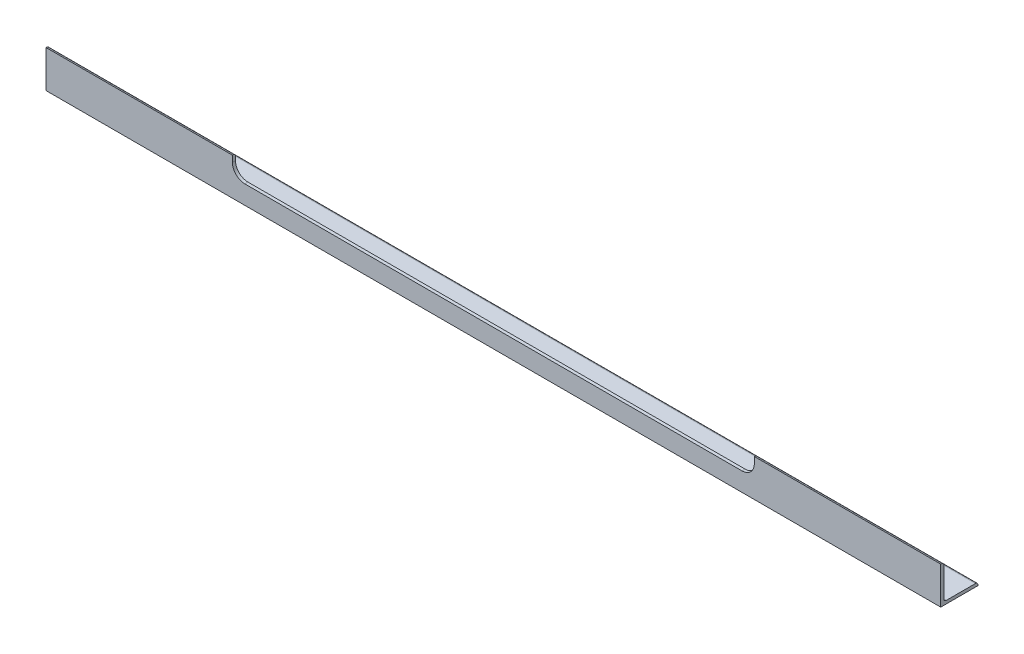
ISO-10303-21;
HEADER;
FILE_DESCRIPTION(('STEP AP214'),'2;1');
FILE_NAME('part.step','',(''),(''),'','','');
FILE_SCHEMA(('AUTOMOTIVE_DESIGN { 1 0 10303 214 1 1 1 1 }'));
ENDSEC;
DATA;
#1=APPLICATION_CONTEXT('core data for automotive mechanical design processes');
#2=APPLICATION_PROTOCOL_DEFINITION('international standard','automotive_design',2000,#1);
#3=PRODUCT_CONTEXT('',#1,'mechanical');
#4=PRODUCT('Part','Part','',(#3));
#5=PRODUCT_RELATED_PRODUCT_CATEGORY('part','',(#4));
#6=PRODUCT_DEFINITION_FORMATION('','',#4);
#7=PRODUCT_DEFINITION_CONTEXT('part definition',#1,'design');
#8=PRODUCT_DEFINITION('design','',#6,#7);
#9=PRODUCT_DEFINITION_SHAPE('','',#8);
#10=(LENGTH_UNIT() NAMED_UNIT(*) SI_UNIT(.MILLI.,.METRE.));
#11=(NAMED_UNIT(*) PLANE_ANGLE_UNIT() SI_UNIT($,.RADIAN.));
#12=(NAMED_UNIT(*) SI_UNIT($,.STERADIAN.) SOLID_ANGLE_UNIT());
#13=UNCERTAINTY_MEASURE_WITH_UNIT(LENGTH_MEASURE(1.E-05),#10,'distance_accuracy_value','');
#14=(GEOMETRIC_REPRESENTATION_CONTEXT(3) GLOBAL_UNCERTAINTY_ASSIGNED_CONTEXT((#13)) GLOBAL_UNIT_ASSIGNED_CONTEXT((#10,
#11,#12)) REPRESENTATION_CONTEXT('',''));
#15=CARTESIAN_POINT('',(0.,0.,0.));
#16=DIRECTION('',(0.,0.,1.));
#17=DIRECTION('',(1.,0.,0.));
#18=AXIS2_PLACEMENT_3D('',#15,#16,#17);
#19=CARTESIAN_POINT('',(-914.4,76.2,0.));
#20=DIRECTION('',(0.,1.,0.));
#21=DIRECTION('',(0.,0.,1.));
#22=AXIS2_PLACEMENT_3D('',#19,#20,#21);
#23=PLANE('',#22);
#24=DIRECTION('',(0.,0.,1.));
#25=VECTOR('',#24,1.);
#26=CARTESIAN_POINT('',(-533.4,76.2,-76.2));
#27=LINE('',#26,#25);
#28=CARTESIAN_POINT('',(-533.4,76.2,-1.27000000000002));
#29=VERTEX_POINT('',#28);
#30=CARTESIAN_POINT('',(-533.4,76.2,0.));
#31=VERTEX_POINT('',#30);
#32=EDGE_CURVE('E167',#29,#31,#27,.T.);
#33=ORIENTED_EDGE('',*,*,#32,.F.);
#34=DIRECTION('',(1.,0.,0.));
#35=VECTOR('',#34,1.);
#36=CARTESIAN_POINT('',(-914.4,76.2,-1.26999999999996));
#37=LINE('',#36,#35);
#38=CARTESIAN_POINT('',(-914.4,76.2,-1.26999999999996));
#39=VERTEX_POINT('',#38);
#40=EDGE_CURVE('E186',#39,#29,#37,.T.);
#41=ORIENTED_EDGE('',*,*,#40,.F.);
#42=DIRECTION('',(0.,0.,1.));
#43=VECTOR('',#42,1.);
#44=CARTESIAN_POINT('',(-914.4,76.2,0.));
#45=LINE('',#44,#43);
#46=CARTESIAN_POINT('',(-914.4,76.2,0.));
#47=VERTEX_POINT('',#46);
#48=EDGE_CURVE('E248',#39,#47,#45,.T.);
#49=ORIENTED_EDGE('',*,*,#48,.T.);
#50=DIRECTION('',(1.,0.,0.));
#51=VECTOR('',#50,1.);
#52=CARTESIAN_POINT('',(-914.4,76.2,0.));
#53=LINE('',#52,#51);
#54=EDGE_CURVE('E173',#47,#31,#53,.T.);
#55=ORIENTED_EDGE('',*,*,#54,.T.);
#56=EDGE_LOOP('',(#33,#41,#49,#55));
#57=FACE_BOUND('',#56,.T.);
#58=ADVANCED_FACE('F37',(#57),#23,.T.);
#59=CARTESIAN_POINT('',(-914.4,71.12,-1.27));
#60=DIRECTION('',(1.,0.,0.));
#61=DIRECTION('',(0.,0.,-1.));
#62=AXIS2_PLACEMENT_3D('',#59,#60,#61);
#63=CYLINDRICAL_SURFACE('',#62,5.08);
#64=CARTESIAN_POINT('',(-533.4,71.12,-1.27));
#65=DIRECTION('',(-1.,0.,0.));
#66=DIRECTION('',(0.,0.,1.));
#67=AXIS2_PLACEMENT_3D('',#64,#65,#66);
#68=CIRCLE('',#67,5.08);
#69=CARTESIAN_POINT('',(-533.4,71.12,-6.35));
#70=VERTEX_POINT('',#69);
#71=EDGE_CURVE('E222',#70,#29,#68,.F.);
#72=ORIENTED_EDGE('',*,*,#71,.F.);
#73=DIRECTION('',(1.,0.,0.));
#74=VECTOR('',#73,1.);
#75=CARTESIAN_POINT('',(-914.4,71.12,-6.35));
#76=LINE('',#75,#74);
#77=CARTESIAN_POINT('',(-914.4,71.12,-6.35));
#78=VERTEX_POINT('',#77);
#79=EDGE_CURVE('E273',#78,#70,#76,.T.);
#80=ORIENTED_EDGE('',*,*,#79,.F.);
#81=CARTESIAN_POINT('',(-914.4,71.12,-1.27));
#82=DIRECTION('',(1.,0.,0.));
#83=DIRECTION('',(0.,0.,-1.));
#84=AXIS2_PLACEMENT_3D('',#81,#82,#83);
#85=CIRCLE('',#84,5.08);
#86=EDGE_CURVE('E174',#78,#39,#85,.T.);
#87=ORIENTED_EDGE('',*,*,#86,.T.);
#88=ORIENTED_EDGE('',*,*,#40,.T.);
#89=EDGE_LOOP('',(#72,#80,#87,#88));
#90=FACE_BOUND('',#89,.T.);
#91=ADVANCED_FACE('F307',(#90),#63,.T.);
#92=DIRECTION('',(0.,0.,1.));
#93=VECTOR('',#92,1.);
#94=CARTESIAN_POINT('',(533.4,76.2,-76.2));
#95=LINE('',#94,#93);
#96=CARTESIAN_POINT('',(533.4,76.2,-1.27));
#97=VERTEX_POINT('',#96);
#98=CARTESIAN_POINT('',(533.4,76.2,0.));
#99=VERTEX_POINT('',#98);
#100=EDGE_CURVE('E153',#97,#99,#95,.T.);
#101=ORIENTED_EDGE('',*,*,#100,.T.);
#102=CARTESIAN_POINT('',(914.4,76.2,0.));
#103=VERTEX_POINT('',#102);
#104=EDGE_CURVE('E164',#99,#103,#53,.T.);
#105=ORIENTED_EDGE('',*,*,#104,.T.);
#106=DIRECTION('',(0.,0.,1.));
#107=VECTOR('',#106,1.);
#108=CARTESIAN_POINT('',(914.4,76.2,0.));
#109=LINE('',#108,#107);
#110=CARTESIAN_POINT('',(914.4,76.2,-1.26999999999996));
#111=VERTEX_POINT('',#110);
#112=EDGE_CURVE('E224',#111,#103,#109,.T.);
#113=ORIENTED_EDGE('',*,*,#112,.F.);
#114=EDGE_CURVE('E166',#97,#111,#37,.T.);
#115=ORIENTED_EDGE('',*,*,#114,.F.);
#116=EDGE_LOOP('',(#101,#105,#113,#115));
#117=FACE_BOUND('',#116,.T.);
#118=ADVANCED_FACE('F162',(#117),#23,.T.);
#119=CARTESIAN_POINT('',(533.4,71.12,-1.27));
#120=DIRECTION('',(1.,0.,0.));
#121=DIRECTION('',(0.,0.,-1.));
#122=AXIS2_PLACEMENT_3D('',#119,#120,#121);
#123=CIRCLE('',#122,5.08);
#124=CARTESIAN_POINT('',(533.4,71.12,-6.35));
#125=VERTEX_POINT('',#124);
#126=EDGE_CURVE('E206',#97,#125,#123,.F.);
#127=ORIENTED_EDGE('',*,*,#126,.F.);
#128=ORIENTED_EDGE('',*,*,#114,.T.);
#129=CARTESIAN_POINT('',(914.4,71.12,-1.27));
#130=DIRECTION('',(1.,0.,0.));
#131=DIRECTION('',(0.,0.,-1.));
#132=AXIS2_PLACEMENT_3D('',#129,#130,#131);
#133=CIRCLE('',#132,5.08);
#134=CARTESIAN_POINT('',(914.4,71.12,-6.35));
#135=VERTEX_POINT('',#134);
#136=EDGE_CURVE('E245',#135,#111,#133,.T.);
#137=ORIENTED_EDGE('',*,*,#136,.F.);
#138=EDGE_CURVE('E276',#125,#135,#76,.T.);
#139=ORIENTED_EDGE('',*,*,#138,.F.);
#140=EDGE_LOOP('',(#127,#128,#137,#139));
#141=FACE_BOUND('',#140,.T.);
#142=ADVANCED_FACE('F316',(#141),#63,.T.);
#143=CARTESIAN_POINT('',(-914.4,71.12,-6.35));
#144=DIRECTION('',(0.,0.,-1.));
#145=DIRECTION('',(-1.,0.,0.));
#146=AXIS2_PLACEMENT_3D('',#143,#144,#145);
#147=PLANE('',#146);
#148=DIRECTION('',(0.,1.,0.));
#149=VECTOR('',#148,1.);
#150=CARTESIAN_POINT('',(-533.4,71.12,-6.35));
#151=LINE('',#150,#149);
#152=CARTESIAN_POINT('',(-533.4,63.5,-6.35));
#153=VERTEX_POINT('',#152);
#154=EDGE_CURVE('E220',#153,#70,#151,.T.);
#155=ORIENTED_EDGE('',*,*,#154,.F.);
#156=CARTESIAN_POINT('',(-508.,63.5,-6.34999999999999));
#157=DIRECTION('',(0.,0.,-1.));
#158=DIRECTION('',(-1.,0.,0.));
#159=AXIS2_PLACEMENT_3D('',#156,#157,#158);
#160=CIRCLE('',#159,25.4);
#161=CARTESIAN_POINT('',(-508.,38.1,-6.35));
#162=VERTEX_POINT('',#161);
#163=EDGE_CURVE('E11',#153,#162,#160,.F.);
#164=ORIENTED_EDGE('',*,*,#163,.T.);
#165=DIRECTION('',(-1.,0.,0.));
#166=VECTOR('',#165,1.);
#167=CARTESIAN_POINT('',(-914.4,38.1,-6.35));
#168=LINE('',#167,#166);
#169=CARTESIAN_POINT('',(508.,38.1,-6.35));
#170=VERTEX_POINT('',#169);
#171=EDGE_CURVE('E203',#170,#162,#168,.T.);
#172=ORIENTED_EDGE('',*,*,#171,.F.);
#173=CARTESIAN_POINT('',(508.,63.5,-6.34999999999999));
#174=DIRECTION('',(0.,0.,-1.));
#175=DIRECTION('',(-1.,0.,0.));
#176=AXIS2_PLACEMENT_3D('',#173,#174,#175);
#177=CIRCLE('',#176,25.4);
#178=CARTESIAN_POINT('',(533.4,63.5,-6.35));
#179=VERTEX_POINT('',#178);
#180=EDGE_CURVE('E194',#170,#179,#177,.F.);
#181=ORIENTED_EDGE('',*,*,#180,.T.);
#182=DIRECTION('',(0.,-1.,0.));
#183=VECTOR('',#182,1.);
#184=CARTESIAN_POINT('',(533.4,71.12,-6.35));
#185=LINE('',#184,#183);
#186=EDGE_CURVE('E200',#125,#179,#185,.T.);
#187=ORIENTED_EDGE('',*,*,#186,.F.);
#188=ORIENTED_EDGE('',*,*,#138,.T.);
#189=DIRECTION('',(0.,1.,0.));
#190=VECTOR('',#189,1.);
#191=CARTESIAN_POINT('',(914.4,71.12,-6.35));
#192=LINE('',#191,#190);
#193=CARTESIAN_POINT('',(914.4,11.43,-6.35));
#194=VERTEX_POINT('',#193);
#195=EDGE_CURVE('E242',#194,#135,#192,.T.);
#196=ORIENTED_EDGE('',*,*,#195,.F.);
#197=DIRECTION('',(1.,0.,0.));
#198=VECTOR('',#197,1.);
#199=CARTESIAN_POINT('',(-914.4,11.43,-6.35));
#200=LINE('',#199,#198);
#201=CARTESIAN_POINT('',(-914.4,11.43,-6.35));
#202=VERTEX_POINT('',#201);
#203=EDGE_CURVE('E277',#202,#194,#200,.T.);
#204=ORIENTED_EDGE('',*,*,#203,.F.);
#205=DIRECTION('',(0.,1.,0.));
#206=VECTOR('',#205,1.);
#207=CARTESIAN_POINT('',(-914.4,71.12,-6.35));
#208=LINE('',#207,#206);
#209=EDGE_CURVE('E179',#202,#78,#208,.T.);
#210=ORIENTED_EDGE('',*,*,#209,.T.);
#211=ORIENTED_EDGE('',*,*,#79,.T.);
#212=EDGE_LOOP('',(#155,#164,#172,#181,#187,#188,#196,#204,#210,#211));
#213=FACE_BOUND('',#212,.T.);
#214=ADVANCED_FACE('F199',(#213),#147,.T.);
#215=CARTESIAN_POINT('',(-914.4,11.43,-11.43));
#216=DIRECTION('',(1.,0.,0.));
#217=DIRECTION('',(0.,0.,-1.));
#218=AXIS2_PLACEMENT_3D('',#215,#216,#217);
#219=CYLINDRICAL_SURFACE('',#218,5.08);
#220=ORIENTED_EDGE('',*,*,#203,.T.);
#221=CARTESIAN_POINT('',(914.4,11.43,-11.43));
#222=DIRECTION('',(-1.,0.,0.));
#223=DIRECTION('',(0.,0.,-1.));
#224=AXIS2_PLACEMENT_3D('',#221,#222,#223);
#225=CIRCLE('',#224,5.08);
#226=CARTESIAN_POINT('',(914.4,6.35,-11.43));
#227=VERTEX_POINT('',#226);
#228=EDGE_CURVE('E239',#227,#194,#225,.T.);
#229=ORIENTED_EDGE('',*,*,#228,.F.);
#230=DIRECTION('',(1.,0.,0.));
#231=VECTOR('',#230,1.);
#232=CARTESIAN_POINT('',(-914.4,6.35,-11.43));
#233=LINE('',#232,#231);
#234=CARTESIAN_POINT('',(-914.4,6.35,-11.43));
#235=VERTEX_POINT('',#234);
#236=EDGE_CURVE('E279',#235,#227,#233,.T.);
#237=ORIENTED_EDGE('',*,*,#236,.F.);
#238=CARTESIAN_POINT('',(-914.4,11.43,-11.43));
#239=DIRECTION('',(-1.,0.,0.));
#240=DIRECTION('',(0.,0.,-1.));
#241=AXIS2_PLACEMENT_3D('',#238,#239,#240);
#242=CIRCLE('',#241,5.08);
#243=EDGE_CURVE('E266',#235,#202,#242,.T.);
#244=ORIENTED_EDGE('',*,*,#243,.T.);
#245=EDGE_LOOP('',(#220,#229,#237,#244));
#246=FACE_BOUND('',#245,.T.);
#247=ADVANCED_FACE('F326',(#246),#219,.F.);
#248=CARTESIAN_POINT('',(-914.4,6.35,-11.43));
#249=DIRECTION('',(0.,1.,0.));
#250=DIRECTION('',(0.,0.,1.));
#251=AXIS2_PLACEMENT_3D('',#248,#249,#250);
#252=PLANE('',#251);
#253=ORIENTED_EDGE('',*,*,#236,.T.);
#254=DIRECTION('',(0.,0.,1.));
#255=VECTOR('',#254,1.);
#256=CARTESIAN_POINT('',(914.4,6.35,-11.43));
#257=LINE('',#256,#255);
#258=CARTESIAN_POINT('',(914.4,6.35,-71.12));
#259=VERTEX_POINT('',#258);
#260=EDGE_CURVE('E236',#259,#227,#257,.T.);
#261=ORIENTED_EDGE('',*,*,#260,.F.);
#262=DIRECTION('',(1.,0.,0.));
#263=VECTOR('',#262,1.);
#264=CARTESIAN_POINT('',(-914.4,6.35,-71.12));
#265=LINE('',#264,#263);
#266=CARTESIAN_POINT('',(-914.4,6.35,-71.12));
#267=VERTEX_POINT('',#266);
#268=EDGE_CURVE('E281',#267,#259,#265,.T.);
#269=ORIENTED_EDGE('',*,*,#268,.F.);
#270=DIRECTION('',(0.,0.,1.));
#271=VECTOR('',#270,1.);
#272=CARTESIAN_POINT('',(-914.4,6.35,-11.43));
#273=LINE('',#272,#271);
#274=EDGE_CURVE('E263',#267,#235,#273,.T.);
#275=ORIENTED_EDGE('',*,*,#274,.T.);
#276=EDGE_LOOP('',(#253,#261,#269,#275));
#277=FACE_BOUND('',#276,.T.);
#278=ADVANCED_FACE('F333',(#277),#252,.T.);
#279=CARTESIAN_POINT('',(-914.4,1.27,-71.12));
#280=DIRECTION('',(1.,0.,0.));
#281=DIRECTION('',(0.,0.,-1.));
#282=AXIS2_PLACEMENT_3D('',#279,#280,#281);
#283=CYLINDRICAL_SURFACE('',#282,5.08);
#284=ORIENTED_EDGE('',*,*,#268,.T.);
#285=CARTESIAN_POINT('',(914.4,1.27,-71.12));
#286=DIRECTION('',(1.,0.,0.));
#287=DIRECTION('',(0.,0.,1.));
#288=AXIS2_PLACEMENT_3D('',#285,#286,#287);
#289=CIRCLE('',#288,5.08);
#290=CARTESIAN_POINT('',(914.4,1.26999999999996,-76.2));
#291=VERTEX_POINT('',#290);
#292=EDGE_CURVE('E233',#291,#259,#289,.T.);
#293=ORIENTED_EDGE('',*,*,#292,.F.);
#294=DIRECTION('',(1.,0.,0.));
#295=VECTOR('',#294,1.);
#296=CARTESIAN_POINT('',(-914.4,1.26999999999996,-76.2));
#297=LINE('',#296,#295);
#298=CARTESIAN_POINT('',(-914.4,1.26999999999996,-76.2));
#299=VERTEX_POINT('',#298);
#300=EDGE_CURVE('E283',#299,#291,#297,.T.);
#301=ORIENTED_EDGE('',*,*,#300,.F.);
#302=CARTESIAN_POINT('',(-914.4,1.27,-71.12));
#303=DIRECTION('',(1.,0.,0.));
#304=DIRECTION('',(0.,0.,1.));
#305=AXIS2_PLACEMENT_3D('',#302,#303,#304);
#306=CIRCLE('',#305,5.08);
#307=EDGE_CURVE('E260',#299,#267,#306,.T.);
#308=ORIENTED_EDGE('',*,*,#307,.T.);
#309=EDGE_LOOP('',(#284,#293,#301,#308));
#310=FACE_BOUND('',#309,.T.);
#311=ADVANCED_FACE('F303',(#310),#283,.T.);
#312=CARTESIAN_POINT('',(-914.4,1.26999999999996,-76.2));
#313=DIRECTION('',(0.,0.,-1.));
#314=DIRECTION('',(-1.,0.,0.));
#315=AXIS2_PLACEMENT_3D('',#312,#313,#314);
#316=PLANE('',#315);
#317=ORIENTED_EDGE('',*,*,#300,.T.);
#318=DIRECTION('',(0.,1.,0.));
#319=VECTOR('',#318,1.);
#320=CARTESIAN_POINT('',(914.4,1.26999999999996,-76.2));
#321=LINE('',#320,#319);
#322=CARTESIAN_POINT('',(914.4,0.,-76.2));
#323=VERTEX_POINT('',#322);
#324=EDGE_CURVE('E230',#323,#291,#321,.T.);
#325=ORIENTED_EDGE('',*,*,#324,.F.);
#326=DIRECTION('',(1.,0.,0.));
#327=VECTOR('',#326,1.);
#328=CARTESIAN_POINT('',(-914.4,0.,-76.2));
#329=LINE('',#328,#327);
#330=CARTESIAN_POINT('',(-914.4,0.,-76.2));
#331=VERTEX_POINT('',#330);
#332=EDGE_CURVE('E284',#331,#323,#329,.T.);
#333=ORIENTED_EDGE('',*,*,#332,.F.);
#334=DIRECTION('',(0.,1.,0.));
#335=VECTOR('',#334,1.);
#336=CARTESIAN_POINT('',(-914.4,1.26999999999996,-76.2));
#337=LINE('',#336,#335);
#338=EDGE_CURVE('E257',#331,#299,#337,.T.);
#339=ORIENTED_EDGE('',*,*,#338,.T.);
#340=EDGE_LOOP('',(#317,#325,#333,#339));
#341=FACE_BOUND('',#340,.T.);
#342=ADVANCED_FACE('F294',(#341),#316,.T.);
#343=CARTESIAN_POINT('',(-914.4,0.,0.));
#344=DIRECTION('',(0.,-1.,0.));
#345=DIRECTION('',(0.,0.,-1.));
#346=AXIS2_PLACEMENT_3D('',#343,#344,#345);
#347=PLANE('',#346);
#348=ORIENTED_EDGE('',*,*,#332,.T.);
#349=DIRECTION('',(0.,0.,-1.));
#350=VECTOR('',#349,1.);
#351=CARTESIAN_POINT('',(914.4,0.,0.));
#352=LINE('',#351,#350);
#353=CARTESIAN_POINT('',(914.4,0.,0.));
#354=VERTEX_POINT('',#353);
#355=EDGE_CURVE('E227',#354,#323,#352,.T.);
#356=ORIENTED_EDGE('',*,*,#355,.F.);
#357=DIRECTION('',(1.,0.,0.));
#358=VECTOR('',#357,1.);
#359=CARTESIAN_POINT('',(-914.4,0.,0.));
#360=LINE('',#359,#358);
#361=CARTESIAN_POINT('',(-914.4,0.,0.));
#362=VERTEX_POINT('',#361);
#363=EDGE_CURVE('E177',#362,#354,#360,.T.);
#364=ORIENTED_EDGE('',*,*,#363,.F.);
#365=DIRECTION('',(0.,0.,-1.));
#366=VECTOR('',#365,1.);
#367=CARTESIAN_POINT('',(-914.4,0.,0.));
#368=LINE('',#367,#366);
#369=EDGE_CURVE('E254',#362,#331,#368,.T.);
#370=ORIENTED_EDGE('',*,*,#369,.T.);
#371=EDGE_LOOP('',(#348,#356,#364,#370));
#372=FACE_BOUND('',#371,.T.);
#373=ADVANCED_FACE('F292',(#372),#347,.T.);
#374=CARTESIAN_POINT('',(-914.4,76.2,0.));
#375=DIRECTION('',(0.,0.,1.));
#376=DIRECTION('',(1.,0.,0.));
#377=AXIS2_PLACEMENT_3D('',#374,#375,#376);
#378=PLANE('',#377);
#379=DIRECTION('',(0.,-1.,0.));
#380=VECTOR('',#379,1.);
#381=CARTESIAN_POINT('',(-533.4,76.2,0.));
#382=LINE('',#381,#380);
#383=CARTESIAN_POINT('',(-533.4,63.5,0.));
#384=VERTEX_POINT('',#383);
#385=EDGE_CURVE('E213',#31,#384,#382,.T.);
#386=ORIENTED_EDGE('',*,*,#385,.F.);
#387=ORIENTED_EDGE('',*,*,#54,.F.);
#388=DIRECTION('',(0.,-1.,0.));
#389=VECTOR('',#388,1.);
#390=CARTESIAN_POINT('',(-914.4,76.2,0.));
#391=LINE('',#390,#389);
#392=EDGE_CURVE('E251',#47,#362,#391,.T.);
#393=ORIENTED_EDGE('',*,*,#392,.T.);
#394=ORIENTED_EDGE('',*,*,#363,.T.);
#395=DIRECTION('',(0.,-1.,0.));
#396=VECTOR('',#395,1.);
#397=CARTESIAN_POINT('',(914.4,76.2,0.));
#398=LINE('',#397,#396);
#399=EDGE_CURVE('E171',#103,#354,#398,.T.);
#400=ORIENTED_EDGE('',*,*,#399,.F.);
#401=ORIENTED_EDGE('',*,*,#104,.F.);
#402=DIRECTION('',(0.,1.,0.));
#403=VECTOR('',#402,1.);
#404=CARTESIAN_POINT('',(533.4,76.2,0.));
#405=LINE('',#404,#403);
#406=CARTESIAN_POINT('',(533.4,63.5,0.));
#407=VERTEX_POINT('',#406);
#408=EDGE_CURVE('E149',#407,#99,#405,.T.);
#409=ORIENTED_EDGE('',*,*,#408,.F.);
#410=CARTESIAN_POINT('',(508.,63.5,0.));
#411=DIRECTION('',(0.,0.,1.));
#412=DIRECTION('',(1.,0.,0.));
#413=AXIS2_PLACEMENT_3D('',#410,#411,#412);
#414=CIRCLE('',#413,25.4);
#415=CARTESIAN_POINT('',(508.,38.1,0.));
#416=VERTEX_POINT('',#415);
#417=EDGE_CURVE('E192',#407,#416,#414,.F.);
#418=ORIENTED_EDGE('',*,*,#417,.T.);
#419=DIRECTION('',(1.,0.,0.));
#420=VECTOR('',#419,1.);
#421=CARTESIAN_POINT('',(-533.4,38.1,0.));
#422=LINE('',#421,#420);
#423=CARTESIAN_POINT('',(-508.,38.1,0.));
#424=VERTEX_POINT('',#423);
#425=EDGE_CURVE('E158',#424,#416,#422,.T.);
#426=ORIENTED_EDGE('',*,*,#425,.F.);
#427=CARTESIAN_POINT('',(-508.,63.5,0.));
#428=DIRECTION('',(0.,0.,1.));
#429=DIRECTION('',(1.,0.,0.));
#430=AXIS2_PLACEMENT_3D('',#427,#428,#429);
#431=CIRCLE('',#430,25.4);
#432=EDGE_CURVE('E45',#424,#384,#431,.F.);
#433=ORIENTED_EDGE('',*,*,#432,.T.);
#434=EDGE_LOOP('',(#386,#387,#393,#394,#400,#401,#409,#418,#426,#433));
#435=FACE_BOUND('',#434,.T.);
#436=ADVANCED_FACE('F169',(#435),#378,.T.);
#437=CARTESIAN_POINT('',(-914.4,71.12,-1.27));
#438=DIRECTION('',(1.,0.,0.));
#439=DIRECTION('',(0.,0.,-1.));
#440=AXIS2_PLACEMENT_3D('',#437,#438,#439);
#441=PLANE('',#440);
#442=ORIENTED_EDGE('',*,*,#48,.F.);
#443=ORIENTED_EDGE('',*,*,#86,.F.);
#444=ORIENTED_EDGE('',*,*,#209,.F.);
#445=ORIENTED_EDGE('',*,*,#243,.F.);
#446=ORIENTED_EDGE('',*,*,#274,.F.);
#447=ORIENTED_EDGE('',*,*,#307,.F.);
#448=ORIENTED_EDGE('',*,*,#338,.F.);
#449=ORIENTED_EDGE('',*,*,#369,.F.);
#450=ORIENTED_EDGE('',*,*,#392,.F.);
#451=EDGE_LOOP('',(#442,#443,#444,#445,#446,#447,#448,#449,#450));
#452=FACE_BOUND('',#451,.T.);
#453=ADVANCED_FACE('F301',(#452),#441,.F.);
#454=CARTESIAN_POINT('',(914.4,71.12,-1.27));
#455=DIRECTION('',(1.,0.,0.));
#456=DIRECTION('',(0.,0.,-1.));
#457=AXIS2_PLACEMENT_3D('',#454,#455,#456);
#458=PLANE('',#457);
#459=ORIENTED_EDGE('',*,*,#112,.T.);
#460=ORIENTED_EDGE('',*,*,#399,.T.);
#461=ORIENTED_EDGE('',*,*,#355,.T.);
#462=ORIENTED_EDGE('',*,*,#324,.T.);
#463=ORIENTED_EDGE('',*,*,#292,.T.);
#464=ORIENTED_EDGE('',*,*,#260,.T.);
#465=ORIENTED_EDGE('',*,*,#228,.T.);
#466=ORIENTED_EDGE('',*,*,#195,.T.);
#467=ORIENTED_EDGE('',*,*,#136,.T.);
#468=EDGE_LOOP('',(#459,#460,#461,#462,#463,#464,#465,#466,#467));
#469=FACE_BOUND('',#468,.T.);
#470=ADVANCED_FACE('F290',(#469),#458,.T.);
#471=CARTESIAN_POINT('',(-533.4,76.2,-76.2));
#472=DIRECTION('',(-1.,0.,0.));
#473=DIRECTION('',(0.,0.,1.));
#474=AXIS2_PLACEMENT_3D('',#471,#472,#473);
#475=PLANE('',#474);
#476=ORIENTED_EDGE('',*,*,#385,.T.);
#477=DIRECTION('',(0.,0.,1.));
#478=VECTOR('',#477,1.);
#479=CARTESIAN_POINT('',(-533.4,63.5,-6.35000000000002));
#480=LINE('',#479,#478);
#481=EDGE_CURVE('E52',#384,#153,#480,.F.);
#482=ORIENTED_EDGE('',*,*,#481,.T.);
#483=ORIENTED_EDGE('',*,*,#154,.T.);
#484=ORIENTED_EDGE('',*,*,#71,.T.);
#485=ORIENTED_EDGE('',*,*,#32,.T.);
#486=EDGE_LOOP('',(#476,#482,#483,#484,#485));
#487=FACE_BOUND('',#486,.T.);
#488=ADVANCED_FACE('F356',(#487),#475,.F.);
#489=CARTESIAN_POINT('',(533.4,76.2,-76.2));
#490=DIRECTION('',(1.,0.,0.));
#491=DIRECTION('',(0.,0.,-1.));
#492=AXIS2_PLACEMENT_3D('',#489,#490,#491);
#493=PLANE('',#492);
#494=ORIENTED_EDGE('',*,*,#186,.T.);
#495=DIRECTION('',(0.,0.,1.));
#496=VECTOR('',#495,1.);
#497=CARTESIAN_POINT('',(533.4,63.5,0.));
#498=LINE('',#497,#496);
#499=EDGE_CURVE('E156',#179,#407,#498,.T.);
#500=ORIENTED_EDGE('',*,*,#499,.T.);
#501=ORIENTED_EDGE('',*,*,#408,.T.);
#502=ORIENTED_EDGE('',*,*,#100,.F.);
#503=ORIENTED_EDGE('',*,*,#126,.T.);
#504=EDGE_LOOP('',(#494,#500,#501,#502,#503));
#505=FACE_BOUND('',#504,.T.);
#506=ADVANCED_FACE('F152',(#505),#493,.F.);
#507=CARTESIAN_POINT('',(-533.4,38.1,-76.2));
#508=DIRECTION('',(0.,-1.,0.));
#509=DIRECTION('',(0.,0.,-1.));
#510=AXIS2_PLACEMENT_3D('',#507,#508,#509);
#511=PLANE('',#510);
#512=ORIENTED_EDGE('',*,*,#425,.T.);
#513=DIRECTION('',(0.,0.,1.));
#514=VECTOR('',#513,1.);
#515=CARTESIAN_POINT('',(508.,38.1,-6.35000000000002));
#516=LINE('',#515,#514);
#517=EDGE_CURVE('E189',#416,#170,#516,.F.);
#518=ORIENTED_EDGE('',*,*,#517,.T.);
#519=ORIENTED_EDGE('',*,*,#171,.T.);
#520=DIRECTION('',(0.,0.,1.));
#521=VECTOR('',#520,1.);
#522=CARTESIAN_POINT('',(-508.,38.1,0.));
#523=LINE('',#522,#521);
#524=EDGE_CURVE('E185',#162,#424,#523,.T.);
#525=ORIENTED_EDGE('',*,*,#524,.T.);
#526=EDGE_LOOP('',(#512,#518,#519,#525));
#527=FACE_BOUND('',#526,.T.);
#528=ADVANCED_FACE('F211',(#527),#511,.F.);
#529=CARTESIAN_POINT('',(508.,63.5,-76.2));
#530=DIRECTION('',(0.,0.,-1.));
#531=DIRECTION('',(-1.,0.,0.));
#532=AXIS2_PLACEMENT_3D('',#529,#530,#531);
#533=CYLINDRICAL_SURFACE('',#532,25.4);
#534=ORIENTED_EDGE('',*,*,#180,.F.);
#535=ORIENTED_EDGE('',*,*,#517,.F.);
#536=ORIENTED_EDGE('',*,*,#417,.F.);
#537=ORIENTED_EDGE('',*,*,#499,.F.);
#538=EDGE_LOOP('',(#534,#535,#536,#537));
#539=FACE_BOUND('',#538,.T.);
#540=ADVANCED_FACE('F208',(#539),#533,.F.);
#541=CARTESIAN_POINT('',(-508.,63.5,-76.2));
#542=DIRECTION('',(0.,0.,-1.));
#543=DIRECTION('',(-1.,0.,0.));
#544=AXIS2_PLACEMENT_3D('',#541,#542,#543);
#545=CYLINDRICAL_SURFACE('',#544,25.4);
#546=ORIENTED_EDGE('',*,*,#163,.F.);
#547=ORIENTED_EDGE('',*,*,#481,.F.);
#548=ORIENTED_EDGE('',*,*,#432,.F.);
#549=ORIENTED_EDGE('',*,*,#524,.F.);
#550=EDGE_LOOP('',(#546,#547,#548,#549));
#551=FACE_BOUND('',#550,.T.);
#552=ADVANCED_FACE('F39',(#551),#545,.F.);
#553=CLOSED_SHELL('',(#58,#91,#118,#142,#214,#247,#278,#311,#342,#373,#436,#453,#470,#488,#506,
#528,#540,#552));
#554=MANIFOLD_SOLID_BREP('B2',#553);
#555=ADVANCED_BREP_SHAPE_REPRESENTATION('',(#18,#554),#14);
#556=SHAPE_DEFINITION_REPRESENTATION(#9,#555);
ENDSEC;
END-ISO-10303-21;
